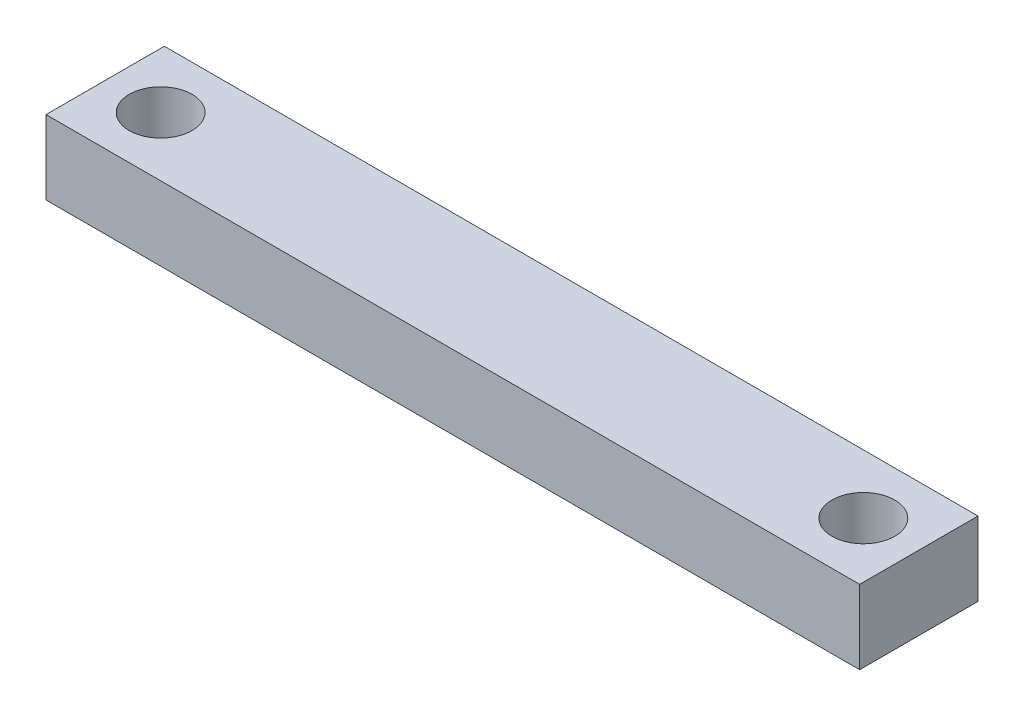
ISO-10303-21;
HEADER;
FILE_DESCRIPTION(('STEP AP214'),'2;1');
FILE_NAME('part.step','',(''),(''),'','','');
FILE_SCHEMA(('AUTOMOTIVE_DESIGN { 1 0 10303 214 1 1 1 1 }'));
ENDSEC;
DATA;
#1=APPLICATION_CONTEXT('core data for automotive mechanical design processes');
#2=APPLICATION_PROTOCOL_DEFINITION('international standard','automotive_design',2000,#1);
#3=PRODUCT_CONTEXT('',#1,'mechanical');
#4=PRODUCT('Part','Part','',(#3));
#5=PRODUCT_RELATED_PRODUCT_CATEGORY('part','',(#4));
#6=PRODUCT_DEFINITION_FORMATION('','',#4);
#7=PRODUCT_DEFINITION_CONTEXT('part definition',#1,'design');
#8=PRODUCT_DEFINITION('design','',#6,#7);
#9=PRODUCT_DEFINITION_SHAPE('','',#8);
#10=(LENGTH_UNIT() NAMED_UNIT(*) SI_UNIT(.MILLI.,.METRE.));
#11=(NAMED_UNIT(*) PLANE_ANGLE_UNIT() SI_UNIT($,.RADIAN.));
#12=(NAMED_UNIT(*) SI_UNIT($,.STERADIAN.) SOLID_ANGLE_UNIT());
#13=UNCERTAINTY_MEASURE_WITH_UNIT(LENGTH_MEASURE(1.E-05),#10,'distance_accuracy_value','');
#14=(GEOMETRIC_REPRESENTATION_CONTEXT(3) GLOBAL_UNCERTAINTY_ASSIGNED_CONTEXT((#13)) GLOBAL_UNIT_ASSIGNED_CONTEXT((#10,
#11,#12)) REPRESENTATION_CONTEXT('',''));
#15=CARTESIAN_POINT('',(0.,0.,0.));
#16=DIRECTION('',(0.,0.,1.));
#17=DIRECTION('',(1.,0.,0.));
#18=AXIS2_PLACEMENT_3D('',#15,#16,#17);
#19=CARTESIAN_POINT('',(55.,10.,-8.));
#20=DIRECTION('',(-1.,0.,0.));
#21=DIRECTION('',(0.,0.,1.));
#22=AXIS2_PLACEMENT_3D('',#19,#20,#21);
#23=PLANE('',#22);
#24=DIRECTION('',(0.,0.,-1.));
#25=VECTOR('',#24,1.);
#26=CARTESIAN_POINT('',(55.,0.,-8.));
#27=LINE('',#26,#25);
#28=CARTESIAN_POINT('',(55.,0.,8.));
#29=VERTEX_POINT('',#28);
#30=CARTESIAN_POINT('',(55.,0.,-8.));
#31=VERTEX_POINT('',#30);
#32=EDGE_CURVE('E113',#29,#31,#27,.T.);
#33=ORIENTED_EDGE('',*,*,#32,.T.);
#34=DIRECTION('',(0.,-1.,0.));
#35=VECTOR('',#34,1.);
#36=CARTESIAN_POINT('',(55.,10.,-8.));
#37=LINE('',#36,#35);
#38=CARTESIAN_POINT('',(55.,10.,-8.));
#39=VERTEX_POINT('',#38);
#40=EDGE_CURVE('E11',#39,#31,#37,.T.);
#41=ORIENTED_EDGE('',*,*,#40,.F.);
#42=DIRECTION('',(0.,0.,-1.));
#43=VECTOR('',#42,1.);
#44=CARTESIAN_POINT('',(55.,10.,-8.));
#45=LINE('',#44,#43);
#46=CARTESIAN_POINT('',(55.,10.,8.));
#47=VERTEX_POINT('',#46);
#48=EDGE_CURVE('E96',#47,#39,#45,.T.);
#49=ORIENTED_EDGE('',*,*,#48,.F.);
#50=DIRECTION('',(0.,-1.,0.));
#51=VECTOR('',#50,1.);
#52=CARTESIAN_POINT('',(55.,10.,8.));
#53=LINE('',#52,#51);
#54=EDGE_CURVE('E109',#47,#29,#53,.T.);
#55=ORIENTED_EDGE('',*,*,#54,.T.);
#56=EDGE_LOOP('',(#33,#41,#49,#55));
#57=FACE_BOUND('',#56,.T.);
#58=ADVANCED_FACE('F43',(#57),#23,.F.);
#59=CARTESIAN_POINT('',(-55.,10.,-8.));
#60=DIRECTION('',(0.,0.,1.));
#61=DIRECTION('',(1.,0.,0.));
#62=AXIS2_PLACEMENT_3D('',#59,#60,#61);
#63=PLANE('',#62);
#64=DIRECTION('',(-1.,0.,0.));
#65=VECTOR('',#64,1.);
#66=CARTESIAN_POINT('',(-55.,0.,-8.));
#67=LINE('',#66,#65);
#68=CARTESIAN_POINT('',(-55.,0.,-8.));
#69=VERTEX_POINT('',#68);
#70=EDGE_CURVE('E101',#31,#69,#67,.T.);
#71=ORIENTED_EDGE('',*,*,#70,.T.);
#72=DIRECTION('',(0.,-1.,0.));
#73=VECTOR('',#72,1.);
#74=CARTESIAN_POINT('',(-55.,10.,-8.));
#75=LINE('',#74,#73);
#76=CARTESIAN_POINT('',(-55.,10.,-8.));
#77=VERTEX_POINT('',#76);
#78=EDGE_CURVE('E53',#77,#69,#75,.T.);
#79=ORIENTED_EDGE('',*,*,#78,.F.);
#80=DIRECTION('',(-1.,0.,0.));
#81=VECTOR('',#80,1.);
#82=CARTESIAN_POINT('',(-55.,10.,-8.));
#83=LINE('',#82,#81);
#84=EDGE_CURVE('E91',#39,#77,#83,.T.);
#85=ORIENTED_EDGE('',*,*,#84,.F.);
#86=ORIENTED_EDGE('',*,*,#40,.T.);
#87=EDGE_LOOP('',(#71,#79,#85,#86));
#88=FACE_BOUND('',#87,.T.);
#89=ADVANCED_FACE('F100',(#88),#63,.F.);
#90=CARTESIAN_POINT('',(-55.,10.,-8.));
#91=DIRECTION('',(1.,0.,0.));
#92=DIRECTION('',(0.,0.,-1.));
#93=AXIS2_PLACEMENT_3D('',#90,#91,#92);
#94=PLANE('',#93);
#95=DIRECTION('',(0.,0.,1.));
#96=VECTOR('',#95,1.);
#97=CARTESIAN_POINT('',(-55.,0.,-8.));
#98=LINE('',#97,#96);
#99=CARTESIAN_POINT('',(-55.,0.,8.));
#100=VERTEX_POINT('',#99);
#101=EDGE_CURVE('E78',#69,#100,#98,.T.);
#102=ORIENTED_EDGE('',*,*,#101,.T.);
#103=DIRECTION('',(0.,-1.,0.));
#104=VECTOR('',#103,1.);
#105=CARTESIAN_POINT('',(-55.,10.,8.));
#106=LINE('',#105,#104);
#107=CARTESIAN_POINT('',(-55.,10.,8.));
#108=VERTEX_POINT('',#107);
#109=EDGE_CURVE('E103',#108,#100,#106,.T.);
#110=ORIENTED_EDGE('',*,*,#109,.F.);
#111=DIRECTION('',(0.,0.,1.));
#112=VECTOR('',#111,1.);
#113=CARTESIAN_POINT('',(-55.,10.,-8.));
#114=LINE('',#113,#112);
#115=EDGE_CURVE('E94',#77,#108,#114,.T.);
#116=ORIENTED_EDGE('',*,*,#115,.F.);
#117=ORIENTED_EDGE('',*,*,#78,.T.);
#118=EDGE_LOOP('',(#102,#110,#116,#117));
#119=FACE_BOUND('',#118,.T.);
#120=ADVANCED_FACE('F105',(#119),#94,.F.);
#121=CARTESIAN_POINT('',(-55.,10.,8.));
#122=DIRECTION('',(0.,0.,-1.));
#123=DIRECTION('',(-1.,0.,0.));
#124=AXIS2_PLACEMENT_3D('',#121,#122,#123);
#125=PLANE('',#124);
#126=DIRECTION('',(1.,0.,0.));
#127=VECTOR('',#126,1.);
#128=CARTESIAN_POINT('',(-55.,0.,8.));
#129=LINE('',#128,#127);
#130=EDGE_CURVE('E84',#100,#29,#129,.T.);
#131=ORIENTED_EDGE('',*,*,#130,.T.);
#132=ORIENTED_EDGE('',*,*,#54,.F.);
#133=DIRECTION('',(1.,0.,0.));
#134=VECTOR('',#133,1.);
#135=CARTESIAN_POINT('',(-55.,10.,8.));
#136=LINE('',#135,#134);
#137=EDGE_CURVE('E61',#108,#47,#136,.T.);
#138=ORIENTED_EDGE('',*,*,#137,.F.);
#139=ORIENTED_EDGE('',*,*,#109,.T.);
#140=EDGE_LOOP('',(#131,#132,#138,#139));
#141=FACE_BOUND('',#140,.T.);
#142=ADVANCED_FACE('F127',(#141),#125,.F.);
#143=CARTESIAN_POINT('',(0.,10.,0.));
#144=DIRECTION('',(0.,1.,0.));
#145=DIRECTION('',(0.,0.,1.));
#146=AXIS2_PLACEMENT_3D('',#143,#144,#145);
#147=PLANE('',#146);
#148=CARTESIAN_POINT('',(-47.5,10.,0.));
#149=DIRECTION('',(0.,1.,0.));
#150=DIRECTION('',(0.,0.,1.));
#151=AXIS2_PLACEMENT_3D('',#148,#149,#150);
#152=CIRCLE('',#151,4.24999999999999);
#153=CARTESIAN_POINT('',(-47.5,10.,4.24999999999999));
#154=VERTEX_POINT('',#153);
#155=EDGE_CURVE('E141',#154,#154,#152,.T.);
#156=ORIENTED_EDGE('',*,*,#155,.F.);
#157=EDGE_LOOP('',(#156));
#158=FACE_BOUND('',#157,.T.);
#159=CARTESIAN_POINT('',(47.5,10.,0.));
#160=DIRECTION('',(0.,1.,0.));
#161=DIRECTION('',(0.,0.,1.));
#162=AXIS2_PLACEMENT_3D('',#159,#160,#161);
#163=CIRCLE('',#162,4.24999999999999);
#164=CARTESIAN_POINT('',(47.5,10.,4.24999999999997));
#165=VERTEX_POINT('',#164);
#166=EDGE_CURVE('E137',#165,#165,#163,.T.);
#167=ORIENTED_EDGE('',*,*,#166,.F.);
#168=EDGE_LOOP('',(#167));
#169=FACE_BOUND('',#168,.T.);
#170=ORIENTED_EDGE('',*,*,#48,.T.);
#171=ORIENTED_EDGE('',*,*,#84,.T.);
#172=ORIENTED_EDGE('',*,*,#115,.T.);
#173=ORIENTED_EDGE('',*,*,#137,.T.);
#174=EDGE_LOOP('',(#170,#171,#172,#173));
#175=FACE_BOUND('',#174,.T.);
#176=ADVANCED_FACE('F92',(#158,#169,#175),#147,.T.);
#177=CARTESIAN_POINT('',(0.,0.,0.));
#178=DIRECTION('',(0.,1.,0.));
#179=DIRECTION('',(0.,0.,1.));
#180=AXIS2_PLACEMENT_3D('',#177,#178,#179);
#181=PLANE('',#180);
#182=CARTESIAN_POINT('',(-47.5,0.,0.));
#183=DIRECTION('',(0.,1.,0.));
#184=DIRECTION('',(0.,0.,1.));
#185=AXIS2_PLACEMENT_3D('',#182,#183,#184);
#186=CIRCLE('',#185,4.24999999999999);
#187=CARTESIAN_POINT('',(-47.5,0.,4.24999999999999));
#188=VERTEX_POINT('',#187);
#189=EDGE_CURVE('E46',#188,#188,#186,.T.);
#190=ORIENTED_EDGE('',*,*,#189,.T.);
#191=EDGE_LOOP('',(#190));
#192=FACE_BOUND('',#191,.T.);
#193=CARTESIAN_POINT('',(47.5,0.,0.));
#194=DIRECTION('',(0.,1.,0.));
#195=DIRECTION('',(0.,0.,1.));
#196=AXIS2_PLACEMENT_3D('',#193,#194,#195);
#197=CIRCLE('',#196,4.24999999999999);
#198=CARTESIAN_POINT('',(47.5,0.,4.24999999999997));
#199=VERTEX_POINT('',#198);
#200=EDGE_CURVE('E117',#199,#199,#197,.T.);
#201=ORIENTED_EDGE('',*,*,#200,.T.);
#202=EDGE_LOOP('',(#201));
#203=FACE_BOUND('',#202,.T.);
#204=ORIENTED_EDGE('',*,*,#32,.F.);
#205=ORIENTED_EDGE('',*,*,#130,.F.);
#206=ORIENTED_EDGE('',*,*,#101,.F.);
#207=ORIENTED_EDGE('',*,*,#70,.F.);
#208=EDGE_LOOP('',(#204,#205,#206,#207));
#209=FACE_BOUND('',#208,.T.);
#210=ADVANCED_FACE('F130',(#192,#203,#209),#181,.F.);
#211=CARTESIAN_POINT('',(47.5,10.,0.));
#212=DIRECTION('',(0.,1.,0.));
#213=DIRECTION('',(0.,0.,1.));
#214=AXIS2_PLACEMENT_3D('',#211,#212,#213);
#215=CYLINDRICAL_SURFACE('',#214,4.24999999999999);
#216=ORIENTED_EDGE('',*,*,#166,.T.);
#217=EDGE_LOOP('',(#216));
#218=FACE_BOUND('',#217,.T.);
#219=ORIENTED_EDGE('',*,*,#200,.F.);
#220=EDGE_LOOP('',(#219));
#221=FACE_BOUND('',#220,.T.);
#222=ADVANCED_FACE('F154',(#218,#221),#215,.F.);
#223=CARTESIAN_POINT('',(-47.5,10.,0.));
#224=DIRECTION('',(0.,1.,0.));
#225=DIRECTION('',(0.,0.,1.));
#226=AXIS2_PLACEMENT_3D('',#223,#224,#225);
#227=CYLINDRICAL_SURFACE('',#226,4.24999999999999);
#228=ORIENTED_EDGE('',*,*,#155,.T.);
#229=EDGE_LOOP('',(#228));
#230=FACE_BOUND('',#229,.T.);
#231=ORIENTED_EDGE('',*,*,#189,.F.);
#232=EDGE_LOOP('',(#231));
#233=FACE_BOUND('',#232,.T.);
#234=ADVANCED_FACE('F152',(#230,#233),#227,.F.);
#235=CLOSED_SHELL('',(#58,#89,#120,#142,#176,#210,#222,#234));
#236=MANIFOLD_SOLID_BREP('B2',#235);
#237=ADVANCED_BREP_SHAPE_REPRESENTATION('',(#18,#236),#14);
#238=SHAPE_DEFINITION_REPRESENTATION(#9,#237);
ENDSEC;
END-ISO-10303-21;
